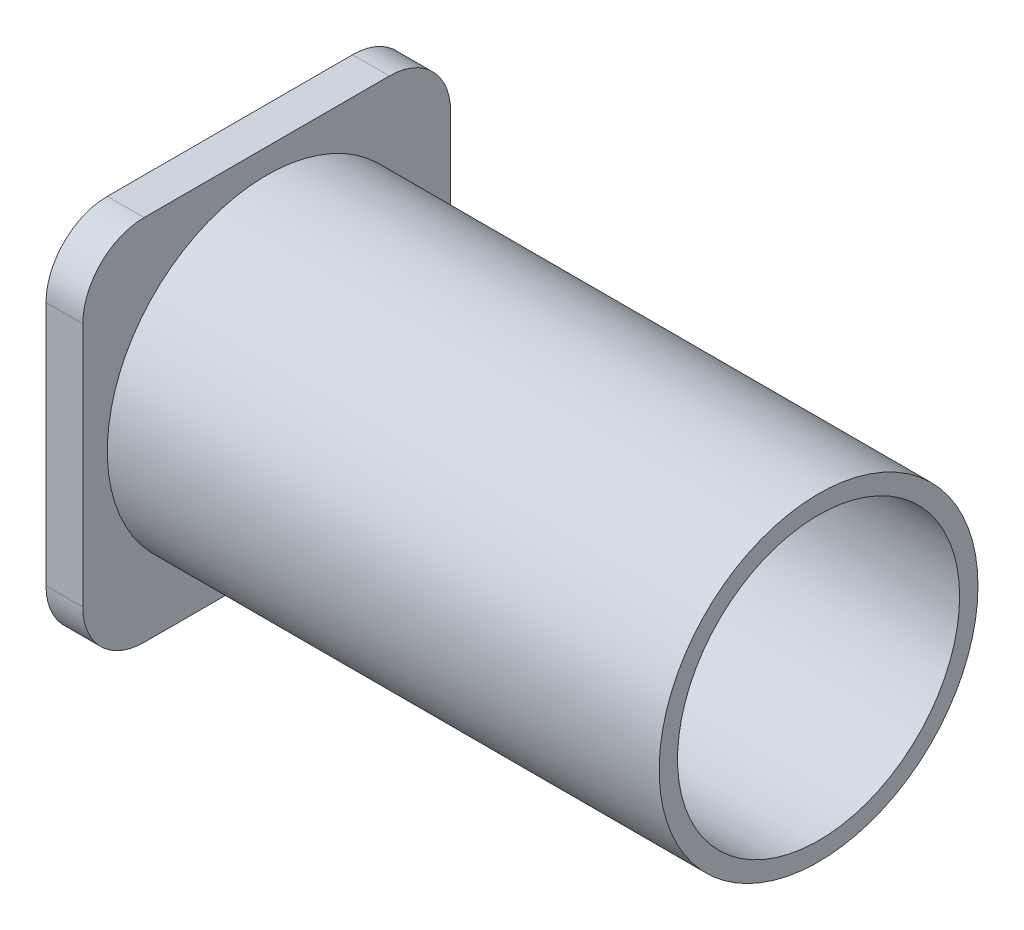
ISO-10303-21;
HEADER;
FILE_DESCRIPTION(('STEP AP214'),'2;1');
FILE_NAME('part.step','',(''),(''),'','','');
FILE_SCHEMA(('AUTOMOTIVE_DESIGN { 1 0 10303 214 1 1 1 1 }'));
ENDSEC;
DATA;
#1=APPLICATION_CONTEXT('core data for automotive mechanical design processes');
#2=APPLICATION_PROTOCOL_DEFINITION('international standard','automotive_design',2000,#1);
#3=PRODUCT_CONTEXT('',#1,'mechanical');
#4=PRODUCT('Part','Part','',(#3));
#5=PRODUCT_RELATED_PRODUCT_CATEGORY('part','',(#4));
#6=PRODUCT_DEFINITION_FORMATION('','',#4);
#7=PRODUCT_DEFINITION_CONTEXT('part definition',#1,'design');
#8=PRODUCT_DEFINITION('design','',#6,#7);
#9=PRODUCT_DEFINITION_SHAPE('','',#8);
#10=(LENGTH_UNIT() NAMED_UNIT(*) SI_UNIT(.MILLI.,.METRE.));
#11=(NAMED_UNIT(*) PLANE_ANGLE_UNIT() SI_UNIT($,.RADIAN.));
#12=(NAMED_UNIT(*) SI_UNIT($,.STERADIAN.) SOLID_ANGLE_UNIT());
#13=UNCERTAINTY_MEASURE_WITH_UNIT(LENGTH_MEASURE(1.E-05),#10,'distance_accuracy_value','');
#14=(GEOMETRIC_REPRESENTATION_CONTEXT(3) GLOBAL_UNCERTAINTY_ASSIGNED_CONTEXT((#13)) GLOBAL_UNIT_ASSIGNED_CONTEXT((#10,
#11,#12)) REPRESENTATION_CONTEXT('',''));
#15=CARTESIAN_POINT('',(0.,0.,0.));
#16=DIRECTION('',(0.,0.,1.));
#17=DIRECTION('',(1.,0.,0.));
#18=AXIS2_PLACEMENT_3D('',#15,#16,#17);
#19=CARTESIAN_POINT('',(45.,0.,0.));
#20=DIRECTION('',(1.,0.,0.));
#21=DIRECTION('',(0.,0.,-1.));
#22=AXIS2_PLACEMENT_3D('',#19,#20,#21);
#23=PLANE('',#22);
#24=CARTESIAN_POINT('',(45.,0.,0.));
#25=DIRECTION('',(1.,0.,0.));
#26=DIRECTION('',(0.,0.,-1.));
#27=AXIS2_PLACEMENT_3D('',#24,#25,#26);
#28=CIRCLE('',#27,13.);
#29=CARTESIAN_POINT('',(45.,0.,-13.));
#30=VERTEX_POINT('',#29);
#31=EDGE_CURVE('E11',#30,#30,#28,.T.);
#32=ORIENTED_EDGE('',*,*,#31,.T.);
#33=EDGE_LOOP('',(#32));
#34=FACE_BOUND('',#33,.T.);
#35=CARTESIAN_POINT('',(45.,0.,0.));
#36=DIRECTION('',(1.,0.,0.));
#37=DIRECTION('',(0.,0.,-1.));
#38=AXIS2_PLACEMENT_3D('',#35,#36,#37);
#39=CIRCLE('',#38,11.5);
#40=CARTESIAN_POINT('',(45.,0.,-11.5));
#41=VERTEX_POINT('',#40);
#42=EDGE_CURVE('E50',#41,#41,#39,.T.);
#43=ORIENTED_EDGE('',*,*,#42,.F.);
#44=EDGE_LOOP('',(#43));
#45=FACE_BOUND('',#44,.T.);
#46=ADVANCED_FACE('F39',(#34,#45),#23,.T.);
#47=CARTESIAN_POINT('',(45.,0.,0.));
#48=DIRECTION('',(-1.,0.,0.));
#49=DIRECTION('',(0.,0.,1.));
#50=AXIS2_PLACEMENT_3D('',#47,#48,#49);
#51=CYLINDRICAL_SURFACE('',#50,13.);
#52=ORIENTED_EDGE('',*,*,#31,.F.);
#53=EDGE_LOOP('',(#52));
#54=FACE_BOUND('',#53,.T.);
#55=CARTESIAN_POINT('',(0.,0.,0.));
#56=DIRECTION('',(1.,0.,0.));
#57=DIRECTION('',(0.,0.,-1.));
#58=AXIS2_PLACEMENT_3D('',#55,#56,#57);
#59=CIRCLE('',#58,13.);
#60=CARTESIAN_POINT('',(0.,0.,-13.));
#61=VERTEX_POINT('',#60);
#62=EDGE_CURVE('E43',#61,#61,#59,.T.);
#63=ORIENTED_EDGE('',*,*,#62,.T.);
#64=EDGE_LOOP('',(#63));
#65=FACE_BOUND('',#64,.T.);
#66=ADVANCED_FACE('F41',(#54,#65),#51,.T.);
#67=CARTESIAN_POINT('',(45.,0.,0.));
#68=DIRECTION('',(-1.,0.,0.));
#69=DIRECTION('',(0.,0.,1.));
#70=AXIS2_PLACEMENT_3D('',#67,#68,#69);
#71=CYLINDRICAL_SURFACE('',#70,11.5);
#72=ORIENTED_EDGE('',*,*,#42,.T.);
#73=EDGE_LOOP('',(#72));
#74=FACE_BOUND('',#73,.T.);
#75=CARTESIAN_POINT('',(0.,0.,0.));
#76=DIRECTION('',(1.,0.,0.));
#77=DIRECTION('',(0.,0.,-1.));
#78=AXIS2_PLACEMENT_3D('',#75,#76,#77);
#79=CIRCLE('',#78,11.5);
#80=CARTESIAN_POINT('',(0.,0.,-11.5));
#81=VERTEX_POINT('',#80);
#82=EDGE_CURVE('E190',#81,#81,#79,.T.);
#83=ORIENTED_EDGE('',*,*,#82,.F.);
#84=EDGE_LOOP('',(#83));
#85=FACE_BOUND('',#84,.T.);
#86=ADVANCED_FACE('F225',(#74,#85),#71,.F.);
#87=CARTESIAN_POINT('',(0.,-10.,-10.));
#88=DIRECTION('',(-1.,0.,0.));
#89=DIRECTION('',(0.,0.,1.));
#90=AXIS2_PLACEMENT_3D('',#87,#88,#89);
#91=PLANE('',#90);
#92=ORIENTED_EDGE('',*,*,#82,.T.);
#93=EDGE_LOOP('',(#92));
#94=FACE_BOUND('',#93,.T.);
#95=ADVANCED_FACE('F204',(#94),#91,.F.);
#96=CARTESIAN_POINT('',(-3.,-10.,-10.));
#97=DIRECTION('',(1.,0.,0.));
#98=DIRECTION('',(0.,0.,-1.));
#99=AXIS2_PLACEMENT_3D('',#96,#97,#98);
#100=CYLINDRICAL_SURFACE('',#99,5.);
#101=CARTESIAN_POINT('',(0.,-10.,-10.));
#102=DIRECTION('',(-1.,0.,0.));
#103=DIRECTION('',(0.,0.,1.));
#104=AXIS2_PLACEMENT_3D('',#101,#102,#103);
#105=CIRCLE('',#104,5.);
#106=CARTESIAN_POINT('',(0.,-9.99999999999996,-15.));
#107=VERTEX_POINT('',#106);
#108=CARTESIAN_POINT('',(0.,-15.,-9.99999999999996));
#109=VERTEX_POINT('',#108);
#110=EDGE_CURVE('E143',#107,#109,#105,.T.);
#111=ORIENTED_EDGE('',*,*,#110,.T.);
#112=DIRECTION('',(1.,0.,0.));
#113=VECTOR('',#112,1.);
#114=CARTESIAN_POINT('',(-3.,-15.,-9.99999999999996));
#115=LINE('',#114,#113);
#116=CARTESIAN_POINT('',(-3.,-15.,-9.99999999999996));
#117=VERTEX_POINT('',#116);
#118=EDGE_CURVE('E184',#117,#109,#115,.T.);
#119=ORIENTED_EDGE('',*,*,#118,.F.);
#120=CARTESIAN_POINT('',(-3.,-10.,-10.));
#121=DIRECTION('',(-1.,0.,0.));
#122=DIRECTION('',(0.,0.,1.));
#123=AXIS2_PLACEMENT_3D('',#120,#121,#122);
#124=CIRCLE('',#123,5.);
#125=CARTESIAN_POINT('',(-3.,-9.99999999999996,-15.));
#126=VERTEX_POINT('',#125);
#127=EDGE_CURVE('E165',#126,#117,#124,.T.);
#128=ORIENTED_EDGE('',*,*,#127,.F.);
#129=DIRECTION('',(1.,0.,0.));
#130=VECTOR('',#129,1.);
#131=CARTESIAN_POINT('',(-3.,-9.99999999999996,-15.));
#132=LINE('',#131,#130);
#133=EDGE_CURVE('E139',#126,#107,#132,.T.);
#134=ORIENTED_EDGE('',*,*,#133,.T.);
#135=EDGE_LOOP('',(#111,#119,#128,#134));
#136=FACE_BOUND('',#135,.T.);
#137=ADVANCED_FACE('F209',(#136),#100,.T.);
#138=CARTESIAN_POINT('',(-3.,-15.,-9.99999999999996));
#139=DIRECTION('',(0.,1.,0.));
#140=DIRECTION('',(0.,0.,1.));
#141=AXIS2_PLACEMENT_3D('',#138,#139,#140);
#142=PLANE('',#141);
#143=DIRECTION('',(0.,0.,1.));
#144=VECTOR('',#143,1.);
#145=CARTESIAN_POINT('',(0.,-15.,-9.99999999999996));
#146=LINE('',#145,#144);
#147=CARTESIAN_POINT('',(0.,-15.,9.99999999999996));
#148=VERTEX_POINT('',#147);
#149=EDGE_CURVE('E147',#109,#148,#146,.T.);
#150=ORIENTED_EDGE('',*,*,#149,.T.);
#151=DIRECTION('',(1.,0.,0.));
#152=VECTOR('',#151,1.);
#153=CARTESIAN_POINT('',(-3.,-15.,9.99999999999996));
#154=LINE('',#153,#152);
#155=CARTESIAN_POINT('',(-3.,-15.,9.99999999999996));
#156=VERTEX_POINT('',#155);
#157=EDGE_CURVE('E180',#156,#148,#154,.T.);
#158=ORIENTED_EDGE('',*,*,#157,.F.);
#159=DIRECTION('',(0.,0.,1.));
#160=VECTOR('',#159,1.);
#161=CARTESIAN_POINT('',(-3.,-15.,-9.99999999999996));
#162=LINE('',#161,#160);
#163=EDGE_CURVE('E102',#117,#156,#162,.T.);
#164=ORIENTED_EDGE('',*,*,#163,.F.);
#165=ORIENTED_EDGE('',*,*,#118,.T.);
#166=EDGE_LOOP('',(#150,#158,#164,#165));
#167=FACE_BOUND('',#166,.T.);
#168=ADVANCED_FACE('F234',(#167),#142,.F.);
#169=CARTESIAN_POINT('',(-3.,-10.,10.));
#170=DIRECTION('',(1.,0.,0.));
#171=DIRECTION('',(0.,0.,-1.));
#172=AXIS2_PLACEMENT_3D('',#169,#170,#171);
#173=CYLINDRICAL_SURFACE('',#172,5.);
#174=CARTESIAN_POINT('',(0.,-10.,10.));
#175=DIRECTION('',(-1.,0.,0.));
#176=DIRECTION('',(0.,0.,1.));
#177=AXIS2_PLACEMENT_3D('',#174,#175,#176);
#178=CIRCLE('',#177,5.);
#179=CARTESIAN_POINT('',(0.,-9.99999999999996,15.));
#180=VERTEX_POINT('',#179);
#181=EDGE_CURVE('E150',#148,#180,#178,.T.);
#182=ORIENTED_EDGE('',*,*,#181,.T.);
#183=DIRECTION('',(1.,0.,0.));
#184=VECTOR('',#183,1.);
#185=CARTESIAN_POINT('',(-3.,-9.99999999999996,15.));
#186=LINE('',#185,#184);
#187=CARTESIAN_POINT('',(-3.,-9.99999999999996,15.));
#188=VERTEX_POINT('',#187);
#189=EDGE_CURVE('E176',#188,#180,#186,.T.);
#190=ORIENTED_EDGE('',*,*,#189,.F.);
#191=CARTESIAN_POINT('',(-3.,-10.,10.));
#192=DIRECTION('',(-1.,0.,0.));
#193=DIRECTION('',(0.,0.,1.));
#194=AXIS2_PLACEMENT_3D('',#191,#192,#193);
#195=CIRCLE('',#194,5.);
#196=EDGE_CURVE('E338',#156,#188,#195,.T.);
#197=ORIENTED_EDGE('',*,*,#196,.F.);
#198=ORIENTED_EDGE('',*,*,#157,.T.);
#199=EDGE_LOOP('',(#182,#190,#197,#198));
#200=FACE_BOUND('',#199,.T.);
#201=ADVANCED_FACE('F237',(#200),#173,.T.);
#202=CARTESIAN_POINT('',(-3.,9.99999999999996,15.));
#203=DIRECTION('',(0.,0.,-1.));
#204=DIRECTION('',(0.,1.,0.));
#205=AXIS2_PLACEMENT_3D('',#202,#203,#204);
#206=PLANE('',#205);
#207=DIRECTION('',(0.,1.,0.));
#208=VECTOR('',#207,1.);
#209=CARTESIAN_POINT('',(0.,9.99999999999996,15.));
#210=LINE('',#209,#208);
#211=CARTESIAN_POINT('',(0.,9.99999999999997,15.));
#212=VERTEX_POINT('',#211);
#213=EDGE_CURVE('E153',#180,#212,#210,.T.);
#214=ORIENTED_EDGE('',*,*,#213,.T.);
#215=DIRECTION('',(1.,0.,0.));
#216=VECTOR('',#215,1.);
#217=CARTESIAN_POINT('',(-3.,9.99999999999997,15.));
#218=LINE('',#217,#216);
#219=CARTESIAN_POINT('',(-3.,9.99999999999997,15.));
#220=VERTEX_POINT('',#219);
#221=EDGE_CURVE('E172',#220,#212,#218,.T.);
#222=ORIENTED_EDGE('',*,*,#221,.F.);
#223=DIRECTION('',(0.,1.,0.));
#224=VECTOR('',#223,1.);
#225=CARTESIAN_POINT('',(-3.,9.99999999999996,15.));
#226=LINE('',#225,#224);
#227=EDGE_CURVE('E336',#188,#220,#226,.T.);
#228=ORIENTED_EDGE('',*,*,#227,.F.);
#229=ORIENTED_EDGE('',*,*,#189,.T.);
#230=EDGE_LOOP('',(#214,#222,#228,#229));
#231=FACE_BOUND('',#230,.T.);
#232=ADVANCED_FACE('F240',(#231),#206,.F.);
#233=CARTESIAN_POINT('',(-3.,10.,10.));
#234=DIRECTION('',(1.,0.,0.));
#235=DIRECTION('',(0.,0.,-1.));
#236=AXIS2_PLACEMENT_3D('',#233,#234,#235);
#237=CYLINDRICAL_SURFACE('',#236,5.);
#238=CARTESIAN_POINT('',(0.,10.,10.));
#239=DIRECTION('',(-1.,0.,0.));
#240=DIRECTION('',(0.,0.,-1.));
#241=AXIS2_PLACEMENT_3D('',#238,#239,#240);
#242=CIRCLE('',#241,5.);
#243=CARTESIAN_POINT('',(0.,15.,9.99999999999996));
#244=VERTEX_POINT('',#243);
#245=EDGE_CURVE('E156',#212,#244,#242,.T.);
#246=ORIENTED_EDGE('',*,*,#245,.T.);
#247=DIRECTION('',(1.,0.,0.));
#248=VECTOR('',#247,1.);
#249=CARTESIAN_POINT('',(-3.,15.,9.99999999999996));
#250=LINE('',#249,#248);
#251=CARTESIAN_POINT('',(-3.,15.,9.99999999999996));
#252=VERTEX_POINT('',#251);
#253=EDGE_CURVE('E132',#252,#244,#250,.T.);
#254=ORIENTED_EDGE('',*,*,#253,.F.);
#255=CARTESIAN_POINT('',(-3.,10.,10.));
#256=DIRECTION('',(-1.,0.,0.));
#257=DIRECTION('',(0.,0.,-1.));
#258=AXIS2_PLACEMENT_3D('',#255,#256,#257);
#259=CIRCLE('',#258,5.);
#260=EDGE_CURVE('E121',#220,#252,#259,.T.);
#261=ORIENTED_EDGE('',*,*,#260,.F.);
#262=ORIENTED_EDGE('',*,*,#221,.T.);
#263=EDGE_LOOP('',(#246,#254,#261,#262));
#264=FACE_BOUND('',#263,.T.);
#265=ADVANCED_FACE('F244',(#264),#237,.T.);
#266=CARTESIAN_POINT('',(-3.,15.,-9.99999999999997));
#267=DIRECTION('',(0.,-1.,0.));
#268=DIRECTION('',(0.,0.,-1.));
#269=AXIS2_PLACEMENT_3D('',#266,#267,#268);
#270=PLANE('',#269);
#271=DIRECTION('',(0.,0.,-1.));
#272=VECTOR('',#271,1.);
#273=CARTESIAN_POINT('',(0.,15.,-9.99999999999997));
#274=LINE('',#273,#272);
#275=CARTESIAN_POINT('',(0.,15.,-9.99999999999997));
#276=VERTEX_POINT('',#275);
#277=EDGE_CURVE('E130',#244,#276,#274,.T.);
#278=ORIENTED_EDGE('',*,*,#277,.T.);
#279=DIRECTION('',(1.,0.,0.));
#280=VECTOR('',#279,1.);
#281=CARTESIAN_POINT('',(-3.,15.,-9.99999999999997));
#282=LINE('',#281,#280);
#283=CARTESIAN_POINT('',(-3.,15.,-9.99999999999997));
#284=VERTEX_POINT('',#283);
#285=EDGE_CURVE('E127',#284,#276,#282,.T.);
#286=ORIENTED_EDGE('',*,*,#285,.F.);
#287=DIRECTION('',(0.,0.,-1.));
#288=VECTOR('',#287,1.);
#289=CARTESIAN_POINT('',(-3.,15.,-9.99999999999997));
#290=LINE('',#289,#288);
#291=EDGE_CURVE('E115',#252,#284,#290,.T.);
#292=ORIENTED_EDGE('',*,*,#291,.F.);
#293=ORIENTED_EDGE('',*,*,#253,.T.);
#294=EDGE_LOOP('',(#278,#286,#292,#293));
#295=FACE_BOUND('',#294,.T.);
#296=ADVANCED_FACE('F128',(#295),#270,.F.);
#297=CARTESIAN_POINT('',(-3.,10.,-10.));
#298=DIRECTION('',(1.,0.,0.));
#299=DIRECTION('',(0.,0.,-1.));
#300=AXIS2_PLACEMENT_3D('',#297,#298,#299);
#301=CYLINDRICAL_SURFACE('',#300,5.);
#302=CARTESIAN_POINT('',(0.,10.,-10.));
#303=DIRECTION('',(-1.,0.,0.));
#304=DIRECTION('',(0.,0.,1.));
#305=AXIS2_PLACEMENT_3D('',#302,#303,#304);
#306=CIRCLE('',#305,5.);
#307=CARTESIAN_POINT('',(0.,9.99999999999996,-15.));
#308=VERTEX_POINT('',#307);
#309=EDGE_CURVE('E87',#276,#308,#306,.T.);
#310=ORIENTED_EDGE('',*,*,#309,.T.);
#311=DIRECTION('',(1.,0.,0.));
#312=VECTOR('',#311,1.);
#313=CARTESIAN_POINT('',(-3.,9.99999999999996,-15.));
#314=LINE('',#313,#312);
#315=CARTESIAN_POINT('',(-3.,9.99999999999996,-15.));
#316=VERTEX_POINT('',#315);
#317=EDGE_CURVE('E133',#316,#308,#314,.T.);
#318=ORIENTED_EDGE('',*,*,#317,.F.);
#319=CARTESIAN_POINT('',(-3.,10.,-10.));
#320=DIRECTION('',(-1.,0.,0.));
#321=DIRECTION('',(0.,0.,1.));
#322=AXIS2_PLACEMENT_3D('',#319,#320,#321);
#323=CIRCLE('',#322,5.);
#324=EDGE_CURVE('E119',#284,#316,#323,.T.);
#325=ORIENTED_EDGE('',*,*,#324,.F.);
#326=ORIENTED_EDGE('',*,*,#285,.T.);
#327=EDGE_LOOP('',(#310,#318,#325,#326));
#328=FACE_BOUND('',#327,.T.);
#329=ADVANCED_FACE('F135',(#328),#301,.T.);
#330=CARTESIAN_POINT('',(-3.,9.99999999999996,-15.));
#331=DIRECTION('',(0.,0.,1.));
#332=DIRECTION('',(0.,-1.,0.));
#333=AXIS2_PLACEMENT_3D('',#330,#331,#332);
#334=PLANE('',#333);
#335=DIRECTION('',(0.,-1.,0.));
#336=VECTOR('',#335,1.);
#337=CARTESIAN_POINT('',(0.,9.99999999999996,-15.));
#338=LINE('',#337,#336);
#339=EDGE_CURVE('E93',#308,#107,#338,.T.);
#340=ORIENTED_EDGE('',*,*,#339,.T.);
#341=ORIENTED_EDGE('',*,*,#133,.F.);
#342=DIRECTION('',(0.,-1.,0.));
#343=VECTOR('',#342,1.);
#344=CARTESIAN_POINT('',(-3.,9.99999999999996,-15.));
#345=LINE('',#344,#343);
#346=EDGE_CURVE('E58',#316,#126,#345,.T.);
#347=ORIENTED_EDGE('',*,*,#346,.F.);
#348=ORIENTED_EDGE('',*,*,#317,.T.);
#349=EDGE_LOOP('',(#340,#341,#347,#348));
#350=FACE_BOUND('',#349,.T.);
#351=ADVANCED_FACE('F211',(#350),#334,.F.);
#352=CARTESIAN_POINT('',(-3.,-10.,-10.));
#353=DIRECTION('',(-1.,0.,0.));
#354=DIRECTION('',(0.,0.,1.));
#355=AXIS2_PLACEMENT_3D('',#352,#353,#354);
#356=PLANE('',#355);
#357=ORIENTED_EDGE('',*,*,#127,.T.);
#358=ORIENTED_EDGE('',*,*,#163,.T.);
#359=ORIENTED_EDGE('',*,*,#196,.T.);
#360=ORIENTED_EDGE('',*,*,#227,.T.);
#361=ORIENTED_EDGE('',*,*,#260,.T.);
#362=ORIENTED_EDGE('',*,*,#291,.T.);
#363=ORIENTED_EDGE('',*,*,#324,.T.);
#364=ORIENTED_EDGE('',*,*,#346,.T.);
#365=EDGE_LOOP('',(#357,#358,#359,#360,#361,#362,#363,#364));
#366=FACE_BOUND('',#365,.T.);
#367=ADVANCED_FACE('F117',(#366),#356,.T.);
#368=ORIENTED_EDGE('',*,*,#62,.F.);
#369=EDGE_LOOP('',(#368));
#370=FACE_BOUND('',#369,.T.);
#371=ORIENTED_EDGE('',*,*,#110,.F.);
#372=ORIENTED_EDGE('',*,*,#339,.F.);
#373=ORIENTED_EDGE('',*,*,#309,.F.);
#374=ORIENTED_EDGE('',*,*,#277,.F.);
#375=ORIENTED_EDGE('',*,*,#245,.F.);
#376=ORIENTED_EDGE('',*,*,#213,.F.);
#377=ORIENTED_EDGE('',*,*,#181,.F.);
#378=ORIENTED_EDGE('',*,*,#149,.F.);
#379=EDGE_LOOP('',(#371,#372,#373,#374,#375,#376,#377,#378));
#380=FACE_BOUND('',#379,.T.);
#381=ADVANCED_FACE('F200',(#370,#380),#91,.F.);
#382=CLOSED_SHELL('',(#46,#66,#86,#95,#137,#168,#201,#232,#265,#296,#329,#351,#367,#381));
#383=MANIFOLD_SOLID_BREP('B2',#382);
#384=ADVANCED_BREP_SHAPE_REPRESENTATION('',(#18,#383),#14);
#385=SHAPE_DEFINITION_REPRESENTATION(#9,#384);
ENDSEC;
END-ISO-10303-21;
